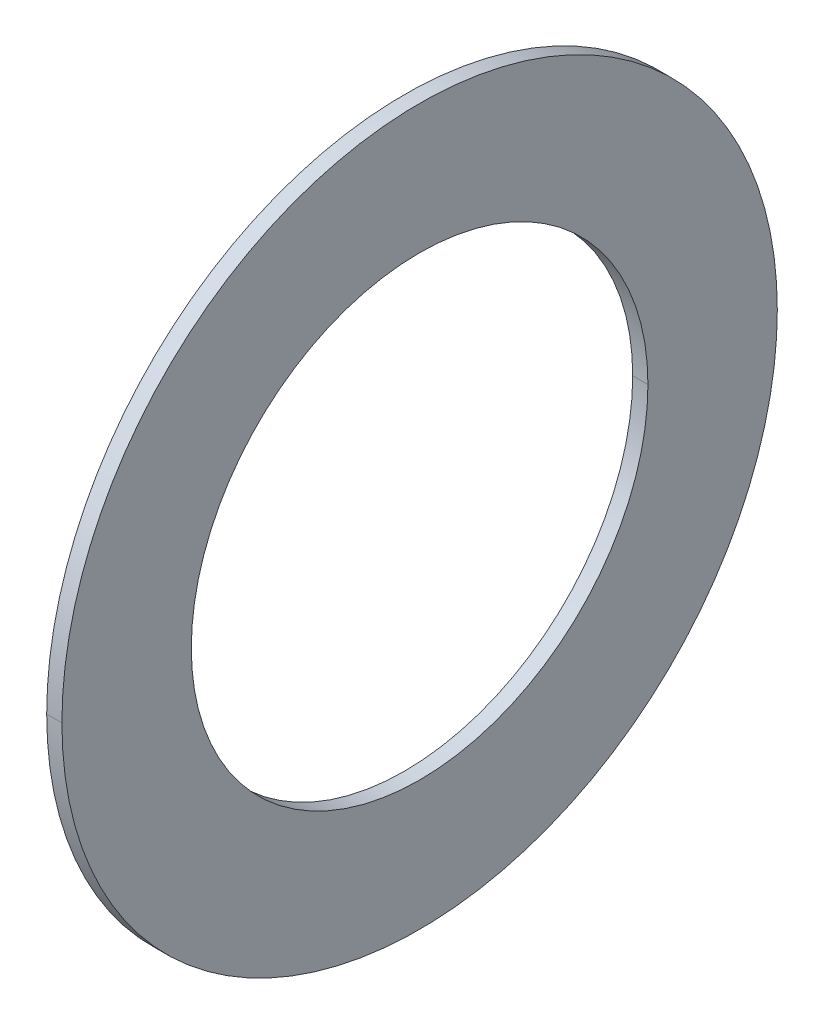
ISO-10303-21;
HEADER;
FILE_DESCRIPTION(('STEP AP214'),'2;1');
FILE_NAME('part.step','',(''),(''),'','','');
FILE_SCHEMA(('AUTOMOTIVE_DESIGN { 1 0 10303 214 1 1 1 1 }'));
ENDSEC;
DATA;
#1=APPLICATION_CONTEXT('core data for automotive mechanical design processes');
#2=APPLICATION_PROTOCOL_DEFINITION('international standard','automotive_design',2000,#1);
#3=PRODUCT_CONTEXT('',#1,'mechanical');
#4=PRODUCT('Part','Part','',(#3));
#5=PRODUCT_RELATED_PRODUCT_CATEGORY('part','',(#4));
#6=PRODUCT_DEFINITION_FORMATION('','',#4);
#7=PRODUCT_DEFINITION_CONTEXT('part definition',#1,'design');
#8=PRODUCT_DEFINITION('design','',#6,#7);
#9=PRODUCT_DEFINITION_SHAPE('','',#8);
#10=(LENGTH_UNIT() NAMED_UNIT(*) SI_UNIT(.MILLI.,.METRE.));
#11=(NAMED_UNIT(*) PLANE_ANGLE_UNIT() SI_UNIT($,.RADIAN.));
#12=(NAMED_UNIT(*) SI_UNIT($,.STERADIAN.) SOLID_ANGLE_UNIT());
#13=UNCERTAINTY_MEASURE_WITH_UNIT(LENGTH_MEASURE(1.E-05),#10,'distance_accuracy_value','');
#14=(GEOMETRIC_REPRESENTATION_CONTEXT(3) GLOBAL_UNCERTAINTY_ASSIGNED_CONTEXT((#13)) GLOBAL_UNIT_ASSIGNED_CONTEXT((#10,
#11,#12)) REPRESENTATION_CONTEXT('',''));
#15=CARTESIAN_POINT('',(0.,0.,0.));
#16=DIRECTION('',(0.,0.,1.));
#17=DIRECTION('',(1.,0.,0.));
#18=AXIS2_PLACEMENT_3D('',#15,#16,#17);
#19=CARTESIAN_POINT('',(1.,23.5,0.));
#20=DIRECTION('',(-1.,0.,0.));
#21=DIRECTION('',(0.,0.,1.));
#22=AXIS2_PLACEMENT_3D('',#19,#20,#21);
#23=PLANE('',#22);
#24=CARTESIAN_POINT('',(1.,0.,0.));
#25=DIRECTION('',(1.,0.,0.));
#26=DIRECTION('',(0.,0.,-1.));
#27=AXIS2_PLACEMENT_3D('',#24,#25,#26);
#28=CIRCLE('',#27,15.);
#29=CARTESIAN_POINT('',(1.,0.,-15.));
#30=VERTEX_POINT('',#29);
#31=CARTESIAN_POINT('',(1.,0.,15.));
#32=VERTEX_POINT('',#31);
#33=EDGE_CURVE('E11',#30,#32,#28,.T.);
#34=ORIENTED_EDGE('',*,*,#33,.T.);
#35=CARTESIAN_POINT('',(1.,0.,0.));
#36=DIRECTION('',(1.,0.,0.));
#37=DIRECTION('',(0.,0.,-1.));
#38=AXIS2_PLACEMENT_3D('',#35,#36,#37);
#39=CIRCLE('',#38,15.);
#40=EDGE_CURVE('E25',#32,#30,#39,.T.);
#41=ORIENTED_EDGE('',*,*,#40,.T.);
#42=EDGE_LOOP('',(#34,#41));
#43=FACE_BOUND('',#42,.T.);
#44=CARTESIAN_POINT('',(1.,0.,0.));
#45=DIRECTION('',(1.,0.,0.));
#46=DIRECTION('',(0.,0.,-1.));
#47=AXIS2_PLACEMENT_3D('',#44,#45,#46);
#48=CIRCLE('',#47,23.5);
#49=CARTESIAN_POINT('',(1.,0.,23.5));
#50=VERTEX_POINT('',#49);
#51=CARTESIAN_POINT('',(1.,0.,-23.5));
#52=VERTEX_POINT('',#51);
#53=EDGE_CURVE('E95',#50,#52,#48,.T.);
#54=ORIENTED_EDGE('',*,*,#53,.F.);
#55=CARTESIAN_POINT('',(1.,0.,0.));
#56=DIRECTION('',(1.,0.,0.));
#57=DIRECTION('',(0.,0.,-1.));
#58=AXIS2_PLACEMENT_3D('',#55,#56,#57);
#59=CIRCLE('',#58,23.5);
#60=EDGE_CURVE('E90',#52,#50,#59,.T.);
#61=ORIENTED_EDGE('',*,*,#60,.F.);
#62=EDGE_LOOP('',(#54,#61));
#63=FACE_BOUND('',#62,.T.);
#64=ADVANCED_FACE('F17',(#43,#63),#23,.T.);
#65=CARTESIAN_POINT('',(50.,0.,0.));
#66=DIRECTION('',(1.,0.,0.));
#67=DIRECTION('',(0.,-1.,0.));
#68=AXIS2_PLACEMENT_3D('',#65,#66,#67);
#69=CYLINDRICAL_SURFACE('',#68,23.5);
#70=DIRECTION('',(1.,0.,0.));
#71=VECTOR('',#70,1.);
#72=CARTESIAN_POINT('',(1.,0.,23.5));
#73=LINE('',#72,#71);
#74=CARTESIAN_POINT('',(2.,0.,23.5));
#75=VERTEX_POINT('',#74);
#76=EDGE_CURVE('E86',#50,#75,#73,.T.);
#77=ORIENTED_EDGE('',*,*,#76,.T.);
#78=CARTESIAN_POINT('',(2.,0.,0.));
#79=DIRECTION('',(1.,0.,0.));
#80=DIRECTION('',(0.,0.,-1.));
#81=AXIS2_PLACEMENT_3D('',#78,#79,#80);
#82=CIRCLE('',#81,23.5);
#83=CARTESIAN_POINT('',(2.,0.,-23.5));
#84=VERTEX_POINT('',#83);
#85=EDGE_CURVE('E81',#84,#75,#82,.T.);
#86=ORIENTED_EDGE('',*,*,#85,.F.);
#87=DIRECTION('',(1.,0.,0.));
#88=VECTOR('',#87,1.);
#89=CARTESIAN_POINT('',(1.,0.,-23.5));
#90=LINE('',#89,#88);
#91=EDGE_CURVE('E70',#52,#84,#90,.T.);
#92=ORIENTED_EDGE('',*,*,#91,.F.);
#93=ORIENTED_EDGE('',*,*,#60,.T.);
#94=EDGE_LOOP('',(#77,#86,#92,#93));
#95=FACE_BOUND('',#94,.T.);
#96=ADVANCED_FACE('F111',(#95),#69,.T.);
#97=CARTESIAN_POINT('',(50.,0.,0.));
#98=DIRECTION('',(1.,0.,0.));
#99=DIRECTION('',(0.,1.,0.));
#100=AXIS2_PLACEMENT_3D('',#97,#98,#99);
#101=CYLINDRICAL_SURFACE('',#100,23.5);
#102=ORIENTED_EDGE('',*,*,#76,.F.);
#103=ORIENTED_EDGE('',*,*,#53,.T.);
#104=ORIENTED_EDGE('',*,*,#91,.T.);
#105=CARTESIAN_POINT('',(2.,0.,0.));
#106=DIRECTION('',(1.,0.,0.));
#107=DIRECTION('',(0.,0.,-1.));
#108=AXIS2_PLACEMENT_3D('',#105,#106,#107);
#109=CIRCLE('',#108,23.5);
#110=EDGE_CURVE('E67',#75,#84,#109,.T.);
#111=ORIENTED_EDGE('',*,*,#110,.F.);
#112=EDGE_LOOP('',(#102,#103,#104,#111));
#113=FACE_BOUND('',#112,.T.);
#114=ADVANCED_FACE('F106',(#113),#101,.T.);
#115=CARTESIAN_POINT('',(2.,15.,0.));
#116=DIRECTION('',(1.,0.,0.));
#117=DIRECTION('',(0.,0.,-1.));
#118=AXIS2_PLACEMENT_3D('',#115,#116,#117);
#119=PLANE('',#118);
#120=ORIENTED_EDGE('',*,*,#85,.T.);
#121=ORIENTED_EDGE('',*,*,#110,.T.);
#122=EDGE_LOOP('',(#120,#121));
#123=FACE_BOUND('',#122,.T.);
#124=CARTESIAN_POINT('',(2.,0.,0.));
#125=DIRECTION('',(1.,0.,0.));
#126=DIRECTION('',(0.,0.,-1.));
#127=AXIS2_PLACEMENT_3D('',#124,#125,#126);
#128=CIRCLE('',#127,15.);
#129=CARTESIAN_POINT('',(2.,0.,15.));
#130=VERTEX_POINT('',#129);
#131=CARTESIAN_POINT('',(2.,0.,-15.));
#132=VERTEX_POINT('',#131);
#133=EDGE_CURVE('E55',#130,#132,#128,.T.);
#134=ORIENTED_EDGE('',*,*,#133,.F.);
#135=CARTESIAN_POINT('',(2.,0.,0.));
#136=DIRECTION('',(1.,0.,0.));
#137=DIRECTION('',(0.,0.,-1.));
#138=AXIS2_PLACEMENT_3D('',#135,#136,#137);
#139=CIRCLE('',#138,15.);
#140=EDGE_CURVE('E51',#132,#130,#139,.T.);
#141=ORIENTED_EDGE('',*,*,#140,.F.);
#142=EDGE_LOOP('',(#134,#141));
#143=FACE_BOUND('',#142,.T.);
#144=ADVANCED_FACE('F53',(#123,#143),#119,.T.);
#145=CARTESIAN_POINT('',(50.,0.,0.));
#146=DIRECTION('',(1.,0.,0.));
#147=DIRECTION('',(0.,-1.,0.));
#148=AXIS2_PLACEMENT_3D('',#145,#146,#147);
#149=CYLINDRICAL_SURFACE('',#148,15.);
#150=DIRECTION('',(1.,0.,0.));
#151=VECTOR('',#150,1.);
#152=CARTESIAN_POINT('',(1.,0.,15.));
#153=LINE('',#152,#151);
#154=EDGE_CURVE('E59',#32,#130,#153,.T.);
#155=ORIENTED_EDGE('',*,*,#154,.F.);
#156=ORIENTED_EDGE('',*,*,#33,.F.);
#157=DIRECTION('',(1.,0.,0.));
#158=VECTOR('',#157,1.);
#159=CARTESIAN_POINT('',(1.,0.,-15.));
#160=LINE('',#159,#158);
#161=EDGE_CURVE('E62',#30,#132,#160,.T.);
#162=ORIENTED_EDGE('',*,*,#161,.T.);
#163=ORIENTED_EDGE('',*,*,#140,.T.);
#164=EDGE_LOOP('',(#155,#156,#162,#163));
#165=FACE_BOUND('',#164,.T.);
#166=ADVANCED_FACE('F63',(#165),#149,.F.);
#167=CARTESIAN_POINT('',(50.,0.,0.));
#168=DIRECTION('',(1.,0.,0.));
#169=DIRECTION('',(0.,1.,0.));
#170=AXIS2_PLACEMENT_3D('',#167,#168,#169);
#171=CYLINDRICAL_SURFACE('',#170,15.);
#172=ORIENTED_EDGE('',*,*,#154,.T.);
#173=ORIENTED_EDGE('',*,*,#133,.T.);
#174=ORIENTED_EDGE('',*,*,#161,.F.);
#175=ORIENTED_EDGE('',*,*,#40,.F.);
#176=EDGE_LOOP('',(#172,#173,#174,#175));
#177=FACE_BOUND('',#176,.T.);
#178=ADVANCED_FACE('F66',(#177),#171,.F.);
#179=CLOSED_SHELL('',(#64,#96,#114,#144,#166,#178));
#180=MANIFOLD_SOLID_BREP('B1',#179);
#181=ADVANCED_BREP_SHAPE_REPRESENTATION('',(#18,#180),#14);
#182=SHAPE_DEFINITION_REPRESENTATION(#9,#181);
ENDSEC;
END-ISO-10303-21;
